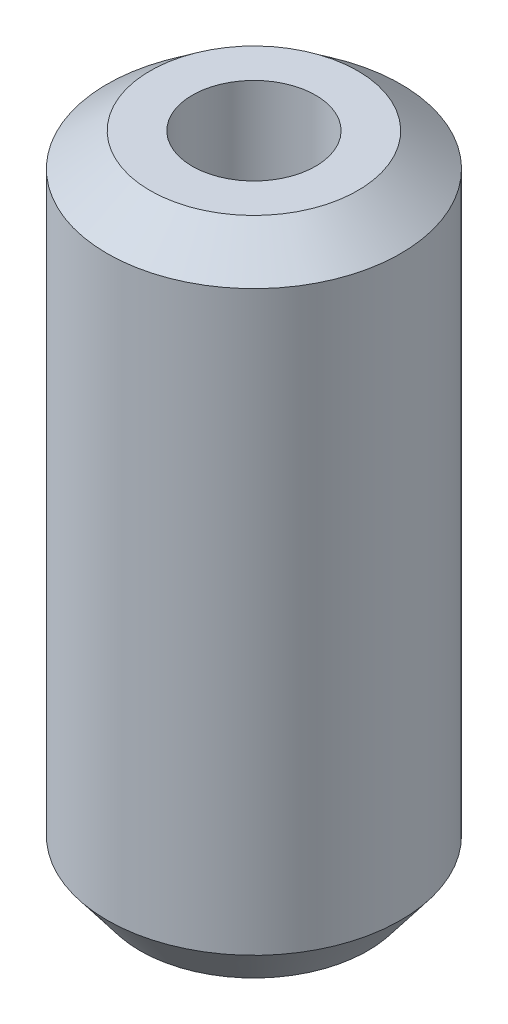
ISO-10303-21;
HEADER;
FILE_DESCRIPTION(('STEP AP214'),'2;1');
FILE_NAME('part.step','',(''),(''),'','','');
FILE_SCHEMA(('AUTOMOTIVE_DESIGN { 1 0 10303 214 1 1 1 1 }'));
ENDSEC;
DATA;
#1=APPLICATION_CONTEXT('core data for automotive mechanical design processes');
#2=APPLICATION_PROTOCOL_DEFINITION('international standard','automotive_design',2000,#1);
#3=PRODUCT_CONTEXT('',#1,'mechanical');
#4=PRODUCT('Part','Part','',(#3));
#5=PRODUCT_RELATED_PRODUCT_CATEGORY('part','',(#4));
#6=PRODUCT_DEFINITION_FORMATION('','',#4);
#7=PRODUCT_DEFINITION_CONTEXT('part definition',#1,'design');
#8=PRODUCT_DEFINITION('design','',#6,#7);
#9=PRODUCT_DEFINITION_SHAPE('','',#8);
#10=(LENGTH_UNIT() NAMED_UNIT(*) SI_UNIT(.MILLI.,.METRE.));
#11=(NAMED_UNIT(*) PLANE_ANGLE_UNIT() SI_UNIT($,.RADIAN.));
#12=(NAMED_UNIT(*) SI_UNIT($,.STERADIAN.) SOLID_ANGLE_UNIT());
#13=UNCERTAINTY_MEASURE_WITH_UNIT(LENGTH_MEASURE(1.E-05),#10,'distance_accuracy_value','');
#14=(GEOMETRIC_REPRESENTATION_CONTEXT(3) GLOBAL_UNCERTAINTY_ASSIGNED_CONTEXT((#13)) GLOBAL_UNIT_ASSIGNED_CONTEXT((#10,
#11,#12)) REPRESENTATION_CONTEXT('',''));
#15=CARTESIAN_POINT('',(0.,0.,0.));
#16=DIRECTION('',(0.,0.,1.));
#17=DIRECTION('',(1.,0.,0.));
#18=AXIS2_PLACEMENT_3D('',#15,#16,#17);
#19=CARTESIAN_POINT('',(0.,44.510007284504,0.));
#20=DIRECTION('',(0.,-1.,0.));
#21=DIRECTION('',(0.,0.,-1.));
#22=AXIS2_PLACEMENT_3D('',#19,#20,#21);
#23=CYLINDRICAL_SURFACE('',#22,10.);
#24=CARTESIAN_POINT('',(0.,42.2621902940541,0.));
#25=DIRECTION('',(0.,1.,0.));
#26=DIRECTION('',(0.,0.,1.));
#27=AXIS2_PLACEMENT_3D('',#24,#25,#26);
#28=CIRCLE('',#27,10.);
#29=CARTESIAN_POINT('',(0.,42.2621902940541,10.));
#30=VERTEX_POINT('',#29);
#31=EDGE_CURVE('E50',#30,#30,#28,.F.);
#32=ORIENTED_EDGE('',*,*,#31,.T.);
#33=EDGE_LOOP('',(#32));
#34=FACE_BOUND('',#33,.T.);
#35=CARTESIAN_POINT('',(0.,2.92920404089899,0.));
#36=DIRECTION('',(0.,1.,0.));
#37=DIRECTION('',(0.,0.,1.));
#38=AXIS2_PLACEMENT_3D('',#35,#36,#37);
#39=CIRCLE('',#38,10.);
#40=CARTESIAN_POINT('',(0.,2.92920404089899,10.));
#41=VERTEX_POINT('',#40);
#42=EDGE_CURVE('E51',#41,#41,#39,.T.);
#43=ORIENTED_EDGE('',*,*,#42,.T.);
#44=EDGE_LOOP('',(#43));
#45=FACE_BOUND('',#44,.T.);
#46=ADVANCED_FACE('F39',(#34,#45),#23,.T.);
#47=CARTESIAN_POINT('',(0.,44.510007284504,0.));
#48=DIRECTION('',(0.,1.,0.));
#49=DIRECTION('',(0.,0.,1.));
#50=AXIS2_PLACEMENT_3D('',#47,#48,#49);
#51=PLANE('',#50);
#52=CARTESIAN_POINT('',(0.,44.510007284504,0.));
#53=DIRECTION('',(0.,1.,0.));
#54=DIRECTION('',(0.,0.,1.));
#55=AXIS2_PLACEMENT_3D('',#52,#53,#54);
#56=CIRCLE('',#55,7.070795959101);
#57=CARTESIAN_POINT('',(0.,44.510007284504,7.070795959101));
#58=VERTEX_POINT('',#57);
#59=EDGE_CURVE('E54',#58,#58,#56,.T.);
#60=ORIENTED_EDGE('',*,*,#59,.T.);
#61=EDGE_LOOP('',(#60));
#62=FACE_BOUND('',#61,.T.);
#63=CARTESIAN_POINT('',(0.,44.510007284504,0.));
#64=DIRECTION('',(0.,1.,0.));
#65=DIRECTION('',(0.,0.,1.));
#66=AXIS2_PLACEMENT_3D('',#63,#64,#65);
#67=CIRCLE('',#66,4.19958083240529);
#68=CARTESIAN_POINT('',(0.,44.510007284504,4.19958083240529));
#69=VERTEX_POINT('',#68);
#70=EDGE_CURVE('E58',#69,#69,#67,.T.);
#71=ORIENTED_EDGE('',*,*,#70,.F.);
#72=EDGE_LOOP('',(#71));
#73=FACE_BOUND('',#72,.T.);
#74=ADVANCED_FACE('F69',(#62,#73),#51,.T.);
#75=CARTESIAN_POINT('',(0.,0.,0.));
#76=DIRECTION('',(0.,1.,0.));
#77=DIRECTION('',(0.,0.,1.));
#78=AXIS2_PLACEMENT_3D('',#75,#76,#77);
#79=PLANE('',#78);
#80=CARTESIAN_POINT('',(0.,0.,0.));
#81=DIRECTION('',(0.,1.,0.));
#82=DIRECTION('',(0.,0.,1.));
#83=AXIS2_PLACEMENT_3D('',#80,#81,#82);
#84=CIRCLE('',#83,7.7521830095501);
#85=CARTESIAN_POINT('',(0.,0.,7.7521830095501));
#86=VERTEX_POINT('',#85);
#87=EDGE_CURVE('E10',#86,#86,#84,.F.);
#88=ORIENTED_EDGE('',*,*,#87,.T.);
#89=EDGE_LOOP('',(#88));
#90=FACE_BOUND('',#89,.T.);
#91=CARTESIAN_POINT('',(0.,0.,0.));
#92=DIRECTION('',(0.,1.,0.));
#93=DIRECTION('',(0.,0.,1.));
#94=AXIS2_PLACEMENT_3D('',#91,#92,#93);
#95=CIRCLE('',#94,4.19958083240529);
#96=CARTESIAN_POINT('',(0.,0.,4.19958083240529));
#97=VERTEX_POINT('',#96);
#98=EDGE_CURVE('E63',#97,#97,#95,.T.);
#99=ORIENTED_EDGE('',*,*,#98,.T.);
#100=EDGE_LOOP('',(#99));
#101=FACE_BOUND('',#100,.T.);
#102=ADVANCED_FACE('F75',(#90,#101),#79,.F.);
#103=CARTESIAN_POINT('',(0.,44.510007284504,0.));
#104=DIRECTION('',(0.,-1.,0.));
#105=DIRECTION('',(0.,0.,-1.));
#106=AXIS2_PLACEMENT_3D('',#103,#104,#105);
#107=CYLINDRICAL_SURFACE('',#106,4.19958083240529);
#108=ORIENTED_EDGE('',*,*,#70,.T.);
#109=EDGE_LOOP('',(#108));
#110=FACE_BOUND('',#109,.T.);
#111=ORIENTED_EDGE('',*,*,#98,.F.);
#112=EDGE_LOOP('',(#111));
#113=FACE_BOUND('',#112,.T.);
#114=ADVANCED_FACE('F70',(#110,#113),#107,.F.);
#115=CARTESIAN_POINT('',(0.,44.510007284504,0.));
#116=DIRECTION('',(0.,-1.,0.));
#117=DIRECTION('',(0.,0.,-1.));
#118=AXIS2_PLACEMENT_3D('',#115,#116,#117);
#119=CONICAL_SURFACE('',#118,7.070795959101,0.916263547871305);
#120=ORIENTED_EDGE('',*,*,#31,.F.);
#121=EDGE_LOOP('',(#120));
#122=FACE_BOUND('',#121,.T.);
#123=ORIENTED_EDGE('',*,*,#59,.F.);
#124=EDGE_LOOP('',(#123));
#125=FACE_BOUND('',#124,.T.);
#126=ADVANCED_FACE('F81',(#122,#125),#119,.T.);
#127=CARTESIAN_POINT('',(0.,2.92920404089899,0.));
#128=DIRECTION('',(0.,1.,0.));
#129=DIRECTION('',(0.,0.,1.));
#130=AXIS2_PLACEMENT_3D('',#127,#128,#129);
#131=CONICAL_SURFACE('',#130,10.,0.654532778923592);
#132=ORIENTED_EDGE('',*,*,#87,.F.);
#133=EDGE_LOOP('',(#132));
#134=FACE_BOUND('',#133,.T.);
#135=ORIENTED_EDGE('',*,*,#42,.F.);
#136=EDGE_LOOP('',(#135));
#137=FACE_BOUND('',#136,.T.);
#138=ADVANCED_FACE('F45',(#134,#137),#131,.T.);
#139=CLOSED_SHELL('',(#46,#74,#102,#114,#126,#138));
#140=MANIFOLD_SOLID_BREP('B2',#139);
#141=ADVANCED_BREP_SHAPE_REPRESENTATION('',(#18,#140),#14);
#142=SHAPE_DEFINITION_REPRESENTATION(#9,#141);
ENDSEC;
END-ISO-10303-21;
